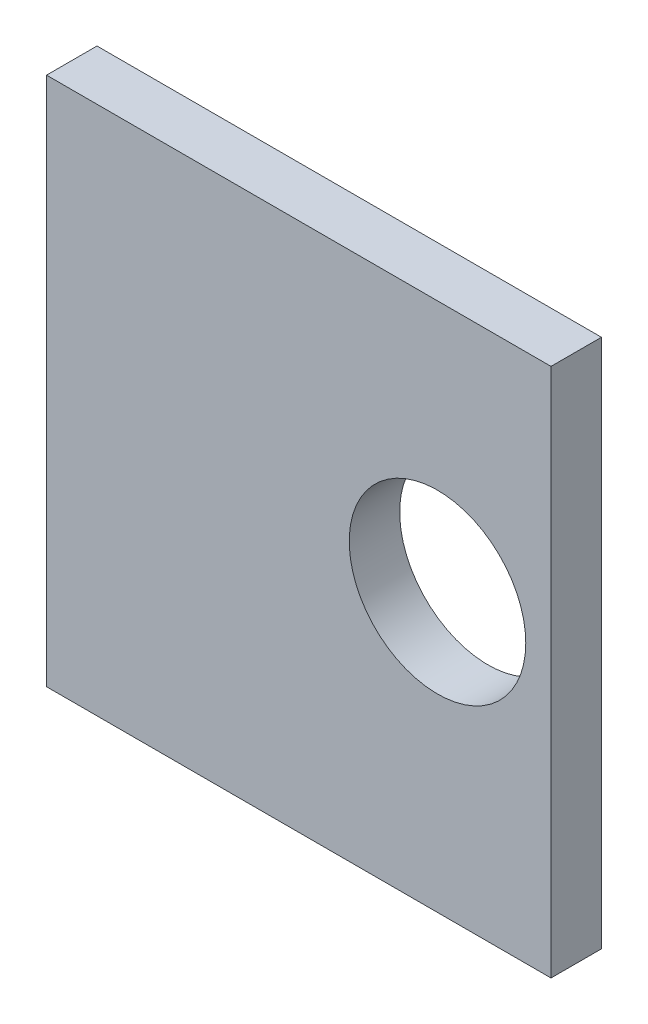
ISO-10303-21;
HEADER;
FILE_DESCRIPTION(('STEP AP214'),'2;1');
FILE_NAME('part.step','',(''),(''),'','','');
FILE_SCHEMA(('AUTOMOTIVE_DESIGN { 1 0 10303 214 1 1 1 1 }'));
ENDSEC;
DATA;
#1=APPLICATION_CONTEXT('core data for automotive mechanical design processes');
#2=APPLICATION_PROTOCOL_DEFINITION('international standard','automotive_design',2000,#1);
#3=PRODUCT_CONTEXT('',#1,'mechanical');
#4=PRODUCT('Part','Part','',(#3));
#5=PRODUCT_RELATED_PRODUCT_CATEGORY('part','',(#4));
#6=PRODUCT_DEFINITION_FORMATION('','',#4);
#7=PRODUCT_DEFINITION_CONTEXT('part definition',#1,'design');
#8=PRODUCT_DEFINITION('design','',#6,#7);
#9=PRODUCT_DEFINITION_SHAPE('','',#8);
#10=(LENGTH_UNIT() NAMED_UNIT(*) SI_UNIT(.MILLI.,.METRE.));
#11=(NAMED_UNIT(*) PLANE_ANGLE_UNIT() SI_UNIT($,.RADIAN.));
#12=(NAMED_UNIT(*) SI_UNIT($,.STERADIAN.) SOLID_ANGLE_UNIT());
#13=UNCERTAINTY_MEASURE_WITH_UNIT(LENGTH_MEASURE(1.E-05),#10,'distance_accuracy_value','');
#14=(GEOMETRIC_REPRESENTATION_CONTEXT(3) GLOBAL_UNCERTAINTY_ASSIGNED_CONTEXT((#13)) GLOBAL_UNIT_ASSIGNED_CONTEXT((#10,
#11,#12)) REPRESENTATION_CONTEXT('',''));
#15=CARTESIAN_POINT('',(0.,0.,0.));
#16=DIRECTION('',(0.,0.,1.));
#17=DIRECTION('',(1.,0.,0.));
#18=AXIS2_PLACEMENT_3D('',#15,#16,#17);
#19=CARTESIAN_POINT('',(0.,0.,6.35));
#20=DIRECTION('',(0.,0.,1.));
#21=DIRECTION('',(1.,0.,0.));
#22=AXIS2_PLACEMENT_3D('',#19,#20,#21);
#23=PLANE('',#22);
#24=DIRECTION('',(0.,-1.,0.));
#25=VECTOR('',#24,1.);
#26=CARTESIAN_POINT('',(-49.2125,31.75,6.35));
#27=LINE('',#26,#25);
#28=CARTESIAN_POINT('',(-49.2125,31.75,6.35));
#29=VERTEX_POINT('',#28);
#30=CARTESIAN_POINT('',(-49.2125,-34.925,6.35));
#31=VERTEX_POINT('',#30);
#32=EDGE_CURVE('E89',#29,#31,#27,.T.);
#33=ORIENTED_EDGE('',*,*,#32,.T.);
#34=DIRECTION('',(1.,0.,0.));
#35=VECTOR('',#34,1.);
#36=CARTESIAN_POINT('',(-49.2125,-34.925,6.35));
#37=LINE('',#36,#35);
#38=CARTESIAN_POINT('',(14.2875,-34.925,6.35));
#39=VERTEX_POINT('',#38);
#40=EDGE_CURVE('E84',#31,#39,#37,.T.);
#41=ORIENTED_EDGE('',*,*,#40,.T.);
#42=DIRECTION('',(0.,1.,0.));
#43=VECTOR('',#42,1.);
#44=CARTESIAN_POINT('',(14.2875,31.75,6.35));
#45=LINE('',#44,#43);
#46=CARTESIAN_POINT('',(14.2875,31.75,6.35));
#47=VERTEX_POINT('',#46);
#48=EDGE_CURVE('E87',#39,#47,#45,.T.);
#49=ORIENTED_EDGE('',*,*,#48,.T.);
#50=DIRECTION('',(-1.,0.,0.));
#51=VECTOR('',#50,1.);
#52=CARTESIAN_POINT('',(-49.2125,31.75,6.35));
#53=LINE('',#52,#51);
#54=EDGE_CURVE('E54',#47,#29,#53,.T.);
#55=ORIENTED_EDGE('',*,*,#54,.T.);
#56=EDGE_LOOP('',(#33,#41,#49,#55));
#57=FACE_BOUND('',#56,.T.);
#58=CARTESIAN_POINT('',(0.,0.,6.35));
#59=DIRECTION('',(0.,0.,1.));
#60=DIRECTION('',(1.,0.,0.));
#61=AXIS2_PLACEMENT_3D('',#58,#59,#60);
#62=CIRCLE('',#61,11.1125);
#63=CARTESIAN_POINT('',(11.1125,0.,6.35));
#64=VERTEX_POINT('',#63);
#65=EDGE_CURVE('E104',#64,#64,#62,.T.);
#66=ORIENTED_EDGE('',*,*,#65,.F.);
#67=EDGE_LOOP('',(#66));
#68=FACE_BOUND('',#67,.T.);
#69=ADVANCED_FACE('F37',(#57,#68),#23,.T.);
#70=CARTESIAN_POINT('',(0.,0.,0.));
#71=DIRECTION('',(0.,0.,1.));
#72=DIRECTION('',(1.,0.,0.));
#73=AXIS2_PLACEMENT_3D('',#70,#71,#72);
#74=PLANE('',#73);
#75=DIRECTION('',(0.,-1.,0.));
#76=VECTOR('',#75,1.);
#77=CARTESIAN_POINT('',(-49.2125,31.75,0.));
#78=LINE('',#77,#76);
#79=CARTESIAN_POINT('',(-49.2125,31.75,0.));
#80=VERTEX_POINT('',#79);
#81=CARTESIAN_POINT('',(-49.2125,-34.925,0.));
#82=VERTEX_POINT('',#81);
#83=EDGE_CURVE('E101',#80,#82,#78,.T.);
#84=ORIENTED_EDGE('',*,*,#83,.F.);
#85=DIRECTION('',(-1.,0.,0.));
#86=VECTOR('',#85,1.);
#87=CARTESIAN_POINT('',(-49.2125,31.75,0.));
#88=LINE('',#87,#86);
#89=CARTESIAN_POINT('',(14.2875,31.75,0.));
#90=VERTEX_POINT('',#89);
#91=EDGE_CURVE('E77',#90,#80,#88,.T.);
#92=ORIENTED_EDGE('',*,*,#91,.F.);
#93=DIRECTION('',(0.,1.,0.));
#94=VECTOR('',#93,1.);
#95=CARTESIAN_POINT('',(14.2875,31.75,0.));
#96=LINE('',#95,#94);
#97=CARTESIAN_POINT('',(14.2875,-34.925,0.));
#98=VERTEX_POINT('',#97);
#99=EDGE_CURVE('E71',#98,#90,#96,.T.);
#100=ORIENTED_EDGE('',*,*,#99,.F.);
#101=DIRECTION('',(1.,0.,0.));
#102=VECTOR('',#101,1.);
#103=CARTESIAN_POINT('',(-49.2125,-34.925,0.));
#104=LINE('',#103,#102);
#105=EDGE_CURVE('E93',#82,#98,#104,.T.);
#106=ORIENTED_EDGE('',*,*,#105,.F.);
#107=EDGE_LOOP('',(#84,#92,#100,#106));
#108=FACE_BOUND('',#107,.T.);
#109=CARTESIAN_POINT('',(0.,0.,0.));
#110=DIRECTION('',(0.,0.,1.));
#111=DIRECTION('',(1.,0.,0.));
#112=AXIS2_PLACEMENT_3D('',#109,#110,#111);
#113=CIRCLE('',#112,11.1125);
#114=CARTESIAN_POINT('',(11.1125,0.,0.));
#115=VERTEX_POINT('',#114);
#116=EDGE_CURVE('E116',#115,#115,#113,.T.);
#117=ORIENTED_EDGE('',*,*,#116,.T.);
#118=EDGE_LOOP('',(#117));
#119=FACE_BOUND('',#118,.T.);
#120=ADVANCED_FACE('F112',(#108,#119),#74,.F.);
#121=CARTESIAN_POINT('',(-49.2125,31.75,6.35));
#122=DIRECTION('',(1.,0.,0.));
#123=DIRECTION('',(0.,0.,-1.));
#124=AXIS2_PLACEMENT_3D('',#121,#122,#123);
#125=PLANE('',#124);
#126=ORIENTED_EDGE('',*,*,#83,.T.);
#127=DIRECTION('',(0.,0.,-1.));
#128=VECTOR('',#127,1.);
#129=CARTESIAN_POINT('',(-49.2125,-34.925,6.35));
#130=LINE('',#129,#128);
#131=EDGE_CURVE('E11',#31,#82,#130,.T.);
#132=ORIENTED_EDGE('',*,*,#131,.F.);
#133=ORIENTED_EDGE('',*,*,#32,.F.);
#134=DIRECTION('',(0.,0.,-1.));
#135=VECTOR('',#134,1.);
#136=CARTESIAN_POINT('',(-49.2125,31.75,6.35));
#137=LINE('',#136,#135);
#138=EDGE_CURVE('E97',#29,#80,#137,.T.);
#139=ORIENTED_EDGE('',*,*,#138,.T.);
#140=EDGE_LOOP('',(#126,#132,#133,#139));
#141=FACE_BOUND('',#140,.T.);
#142=ADVANCED_FACE('F39',(#141),#125,.F.);
#143=CARTESIAN_POINT('',(-49.2125,-34.925,6.35));
#144=DIRECTION('',(0.,1.,0.));
#145=DIRECTION('',(0.,0.,1.));
#146=AXIS2_PLACEMENT_3D('',#143,#144,#145);
#147=PLANE('',#146);
#148=ORIENTED_EDGE('',*,*,#105,.T.);
#149=DIRECTION('',(0.,0.,-1.));
#150=VECTOR('',#149,1.);
#151=CARTESIAN_POINT('',(14.2875,-34.925,6.35));
#152=LINE('',#151,#150);
#153=EDGE_CURVE('E46',#39,#98,#152,.T.);
#154=ORIENTED_EDGE('',*,*,#153,.F.);
#155=ORIENTED_EDGE('',*,*,#40,.F.);
#156=ORIENTED_EDGE('',*,*,#131,.T.);
#157=EDGE_LOOP('',(#148,#154,#155,#156));
#158=FACE_BOUND('',#157,.T.);
#159=ADVANCED_FACE('F92',(#158),#147,.F.);
#160=CARTESIAN_POINT('',(14.2875,31.75,6.35));
#161=DIRECTION('',(-1.,0.,0.));
#162=DIRECTION('',(0.,-1.,0.));
#163=AXIS2_PLACEMENT_3D('',#160,#161,#162);
#164=PLANE('',#163);
#165=ORIENTED_EDGE('',*,*,#99,.T.);
#166=DIRECTION('',(0.,0.,-1.));
#167=VECTOR('',#166,1.);
#168=CARTESIAN_POINT('',(14.2875,31.75,6.35));
#169=LINE('',#168,#167);
#170=EDGE_CURVE('E94',#47,#90,#169,.T.);
#171=ORIENTED_EDGE('',*,*,#170,.F.);
#172=ORIENTED_EDGE('',*,*,#48,.F.);
#173=ORIENTED_EDGE('',*,*,#153,.T.);
#174=EDGE_LOOP('',(#165,#171,#172,#173));
#175=FACE_BOUND('',#174,.T.);
#176=ADVANCED_FACE('F95',(#175),#164,.F.);
#177=CARTESIAN_POINT('',(-49.2125,31.75,6.35));
#178=DIRECTION('',(0.,-1.,0.));
#179=DIRECTION('',(0.,0.,-1.));
#180=AXIS2_PLACEMENT_3D('',#177,#178,#179);
#181=PLANE('',#180);
#182=ORIENTED_EDGE('',*,*,#91,.T.);
#183=ORIENTED_EDGE('',*,*,#138,.F.);
#184=ORIENTED_EDGE('',*,*,#54,.F.);
#185=ORIENTED_EDGE('',*,*,#170,.T.);
#186=EDGE_LOOP('',(#182,#183,#184,#185));
#187=FACE_BOUND('',#186,.T.);
#188=ADVANCED_FACE('F109',(#187),#181,.F.);
#189=CARTESIAN_POINT('',(0.,0.,6.35));
#190=DIRECTION('',(0.,0.,-1.));
#191=DIRECTION('',(-1.,0.,0.));
#192=AXIS2_PLACEMENT_3D('',#189,#190,#191);
#193=CYLINDRICAL_SURFACE('',#192,11.1125);
#194=ORIENTED_EDGE('',*,*,#65,.T.);
#195=EDGE_LOOP('',(#194));
#196=FACE_BOUND('',#195,.T.);
#197=ORIENTED_EDGE('',*,*,#116,.F.);
#198=EDGE_LOOP('',(#197));
#199=FACE_BOUND('',#198,.T.);
#200=ADVANCED_FACE('F122',(#196,#199),#193,.F.);
#201=CLOSED_SHELL('',(#69,#120,#142,#159,#176,#188,#200));
#202=MANIFOLD_SOLID_BREP('B2',#201);
#203=ADVANCED_BREP_SHAPE_REPRESENTATION('',(#18,#202),#14);
#204=SHAPE_DEFINITION_REPRESENTATION(#9,#203);
ENDSEC;
END-ISO-10303-21;
